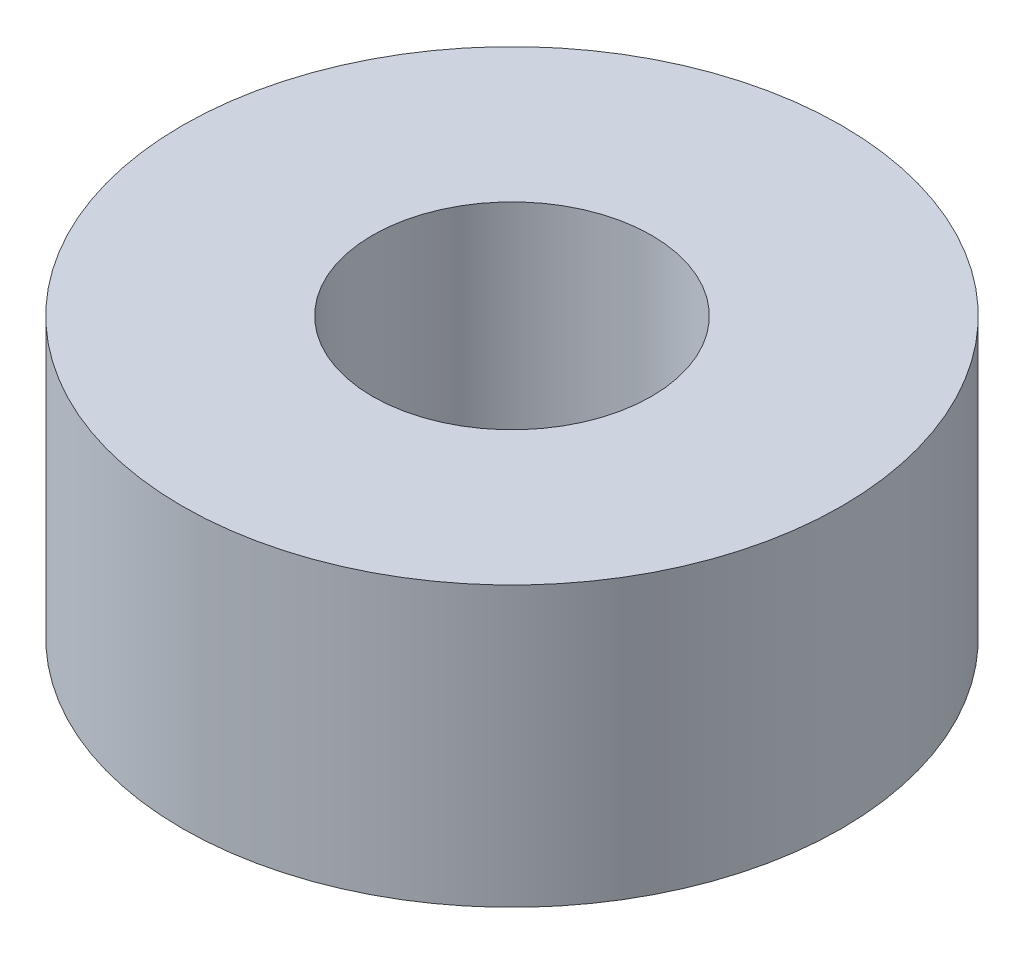
ISO-10303-21;
HEADER;
FILE_DESCRIPTION(('STEP AP214'),'2;1');
FILE_NAME('part.step','',(''),(''),'','','');
FILE_SCHEMA(('AUTOMOTIVE_DESIGN { 1 0 10303 214 1 1 1 1 }'));
ENDSEC;
DATA;
#1=APPLICATION_CONTEXT('core data for automotive mechanical design processes');
#2=APPLICATION_PROTOCOL_DEFINITION('international standard','automotive_design',2000,#1);
#3=PRODUCT_CONTEXT('',#1,'mechanical');
#4=PRODUCT('Part','Part','',(#3));
#5=PRODUCT_RELATED_PRODUCT_CATEGORY('part','',(#4));
#6=PRODUCT_DEFINITION_FORMATION('','',#4);
#7=PRODUCT_DEFINITION_CONTEXT('part definition',#1,'design');
#8=PRODUCT_DEFINITION('design','',#6,#7);
#9=PRODUCT_DEFINITION_SHAPE('','',#8);
#10=(LENGTH_UNIT() NAMED_UNIT(*) SI_UNIT(.MILLI.,.METRE.));
#11=(NAMED_UNIT(*) PLANE_ANGLE_UNIT() SI_UNIT($,.RADIAN.));
#12=(NAMED_UNIT(*) SI_UNIT($,.STERADIAN.) SOLID_ANGLE_UNIT());
#13=UNCERTAINTY_MEASURE_WITH_UNIT(LENGTH_MEASURE(1.E-05),#10,'distance_accuracy_value','');
#14=(GEOMETRIC_REPRESENTATION_CONTEXT(3) GLOBAL_UNCERTAINTY_ASSIGNED_CONTEXT((#13)) GLOBAL_UNIT_ASSIGNED_CONTEXT((#10,
#11,#12)) REPRESENTATION_CONTEXT('',''));
#15=CARTESIAN_POINT('',(0.,0.,0.));
#16=DIRECTION('',(0.,0.,1.));
#17=DIRECTION('',(1.,0.,0.));
#18=AXIS2_PLACEMENT_3D('',#15,#16,#17);
#19=CARTESIAN_POINT('',(0.,6.35,0.));
#20=DIRECTION('',(0.,1.,0.));
#21=DIRECTION('',(0.,0.,1.));
#22=AXIS2_PLACEMENT_3D('',#19,#20,#21);
#23=PLANE('',#22);
#24=CARTESIAN_POINT('',(0.,6.35,0.));
#25=DIRECTION('',(0.,1.,0.));
#26=DIRECTION('',(0.,0.,1.));
#27=AXIS2_PLACEMENT_3D('',#24,#25,#26);
#28=CIRCLE('',#27,7.5);
#29=CARTESIAN_POINT('',(0.,6.35,7.5));
#30=VERTEX_POINT('',#29);
#31=EDGE_CURVE('E10',#30,#30,#28,.T.);
#32=ORIENTED_EDGE('',*,*,#31,.T.);
#33=EDGE_LOOP('',(#32));
#34=FACE_BOUND('',#33,.T.);
#35=CARTESIAN_POINT('',(0.,6.35,0.));
#36=DIRECTION('',(0.,1.,0.));
#37=DIRECTION('',(0.,0.,1.));
#38=AXIS2_PLACEMENT_3D('',#35,#36,#37);
#39=CIRCLE('',#38,3.175);
#40=CARTESIAN_POINT('',(0.,6.35,3.175));
#41=VERTEX_POINT('',#40);
#42=EDGE_CURVE('E54',#41,#41,#39,.T.);
#43=ORIENTED_EDGE('',*,*,#42,.F.);
#44=EDGE_LOOP('',(#43));
#45=FACE_BOUND('',#44,.T.);
#46=ADVANCED_FACE('F41',(#34,#45),#23,.T.);
#47=CARTESIAN_POINT('',(0.,0.,0.));
#48=DIRECTION('',(0.,1.,0.));
#49=DIRECTION('',(0.,0.,1.));
#50=AXIS2_PLACEMENT_3D('',#47,#48,#49);
#51=PLANE('',#50);
#52=CARTESIAN_POINT('',(0.,0.,0.));
#53=DIRECTION('',(0.,1.,0.));
#54=DIRECTION('',(0.,0.,1.));
#55=AXIS2_PLACEMENT_3D('',#52,#53,#54);
#56=CIRCLE('',#55,7.5);
#57=CARTESIAN_POINT('',(0.,0.,7.5));
#58=VERTEX_POINT('',#57);
#59=EDGE_CURVE('E45',#58,#58,#56,.T.);
#60=ORIENTED_EDGE('',*,*,#59,.F.);
#61=EDGE_LOOP('',(#60));
#62=FACE_BOUND('',#61,.T.);
#63=CARTESIAN_POINT('',(0.,0.,0.));
#64=DIRECTION('',(0.,1.,0.));
#65=DIRECTION('',(0.,0.,1.));
#66=AXIS2_PLACEMENT_3D('',#63,#64,#65);
#67=CIRCLE('',#66,3.175);
#68=CARTESIAN_POINT('',(0.,0.,3.175));
#69=VERTEX_POINT('',#68);
#70=EDGE_CURVE('E56',#69,#69,#67,.T.);
#71=ORIENTED_EDGE('',*,*,#70,.T.);
#72=EDGE_LOOP('',(#71));
#73=FACE_BOUND('',#72,.T.);
#74=ADVANCED_FACE('F68',(#62,#73),#51,.F.);
#75=CARTESIAN_POINT('',(0.,6.35,0.));
#76=DIRECTION('',(0.,-1.,0.));
#77=DIRECTION('',(0.,0.,-1.));
#78=AXIS2_PLACEMENT_3D('',#75,#76,#77);
#79=CYLINDRICAL_SURFACE('',#78,7.5);
#80=ORIENTED_EDGE('',*,*,#31,.F.);
#81=EDGE_LOOP('',(#80));
#82=FACE_BOUND('',#81,.T.);
#83=ORIENTED_EDGE('',*,*,#59,.T.);
#84=EDGE_LOOP('',(#83));
#85=FACE_BOUND('',#84,.T.);
#86=ADVANCED_FACE('F43',(#82,#85),#79,.T.);
#87=CARTESIAN_POINT('',(0.,6.35,0.));
#88=DIRECTION('',(0.,-1.,0.));
#89=DIRECTION('',(0.,0.,-1.));
#90=AXIS2_PLACEMENT_3D('',#87,#88,#89);
#91=CYLINDRICAL_SURFACE('',#90,3.175);
#92=ORIENTED_EDGE('',*,*,#42,.T.);
#93=EDGE_LOOP('',(#92));
#94=FACE_BOUND('',#93,.T.);
#95=ORIENTED_EDGE('',*,*,#70,.F.);
#96=EDGE_LOOP('',(#95));
#97=FACE_BOUND('',#96,.T.);
#98=ADVANCED_FACE('F64',(#94,#97),#91,.F.);
#99=CLOSED_SHELL('',(#46,#74,#86,#98));
#100=MANIFOLD_SOLID_BREP('B2',#99);
#101=ADVANCED_BREP_SHAPE_REPRESENTATION('',(#18,#100),#14);
#102=SHAPE_DEFINITION_REPRESENTATION(#9,#101);
ENDSEC;
END-ISO-10303-21;
